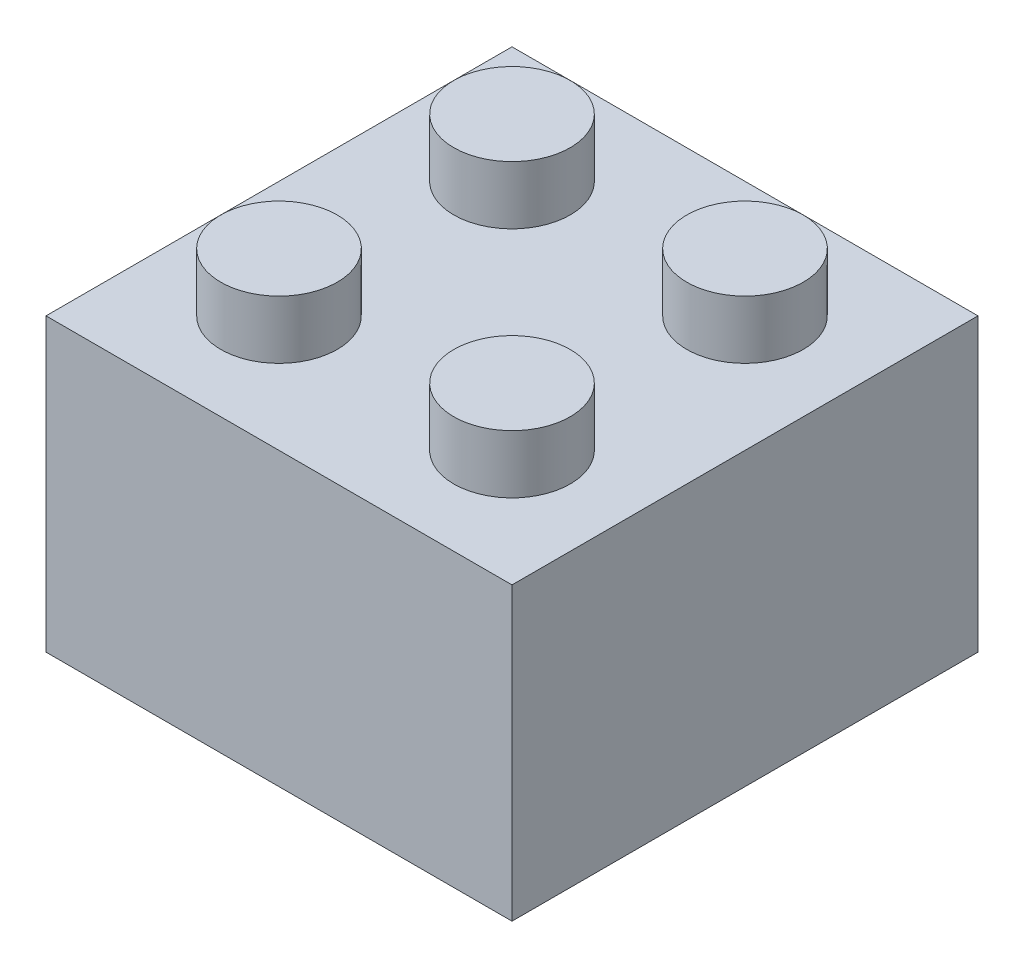
ISO-10303-21;
HEADER;
FILE_DESCRIPTION(('STEP AP214'),'2;1');
FILE_NAME('part.step','',(''),(''),'','','');
FILE_SCHEMA(('AUTOMOTIVE_DESIGN { 1 0 10303 214 1 1 1 1 }'));
ENDSEC;
DATA;
#1=APPLICATION_CONTEXT('core data for automotive mechanical design processes');
#2=APPLICATION_PROTOCOL_DEFINITION('international standard','automotive_design',2000,#1);
#3=PRODUCT_CONTEXT('',#1,'mechanical');
#4=PRODUCT('Part','Part','',(#3));
#5=PRODUCT_RELATED_PRODUCT_CATEGORY('part','',(#4));
#6=PRODUCT_DEFINITION_FORMATION('','',#4);
#7=PRODUCT_DEFINITION_CONTEXT('part definition',#1,'design');
#8=PRODUCT_DEFINITION('design','',#6,#7);
#9=PRODUCT_DEFINITION_SHAPE('','',#8);
#10=(LENGTH_UNIT() NAMED_UNIT(*) SI_UNIT(.MILLI.,.METRE.));
#11=(NAMED_UNIT(*) PLANE_ANGLE_UNIT() SI_UNIT($,.RADIAN.));
#12=(NAMED_UNIT(*) SI_UNIT($,.STERADIAN.) SOLID_ANGLE_UNIT());
#13=UNCERTAINTY_MEASURE_WITH_UNIT(LENGTH_MEASURE(1.E-05),#10,'distance_accuracy_value','');
#14=(GEOMETRIC_REPRESENTATION_CONTEXT(3) GLOBAL_UNCERTAINTY_ASSIGNED_CONTEXT((#13)) GLOBAL_UNIT_ASSIGNED_CONTEXT((#10,
#11,#12)) REPRESENTATION_CONTEXT('',''));
#15=CARTESIAN_POINT('',(0.,0.,0.));
#16=DIRECTION('',(0.,0.,1.));
#17=DIRECTION('',(1.,0.,0.));
#18=AXIS2_PLACEMENT_3D('',#15,#16,#17);
#19=CARTESIAN_POINT('',(8.,10.,-8.));
#20=DIRECTION('',(-1.,0.,0.));
#21=DIRECTION('',(0.,0.,1.));
#22=AXIS2_PLACEMENT_3D('',#19,#20,#21);
#23=PLANE('',#22);
#24=DIRECTION('',(0.,0.,-1.));
#25=VECTOR('',#24,1.);
#26=CARTESIAN_POINT('',(8.,0.,-8.));
#27=LINE('',#26,#25);
#28=CARTESIAN_POINT('',(8.,0.,8.));
#29=VERTEX_POINT('',#28);
#30=CARTESIAN_POINT('',(8.,0.,-8.));
#31=VERTEX_POINT('',#30);
#32=EDGE_CURVE('E204',#29,#31,#27,.T.);
#33=ORIENTED_EDGE('',*,*,#32,.T.);
#34=DIRECTION('',(0.,-1.,0.));
#35=VECTOR('',#34,1.);
#36=CARTESIAN_POINT('',(8.,10.,-8.));
#37=LINE('',#36,#35);
#38=CARTESIAN_POINT('',(8.,10.,-8.));
#39=VERTEX_POINT('',#38);
#40=EDGE_CURVE('E49',#39,#31,#37,.T.);
#41=ORIENTED_EDGE('',*,*,#40,.F.);
#42=DIRECTION('',(0.,0.,-1.));
#43=VECTOR('',#42,1.);
#44=CARTESIAN_POINT('',(8.,10.,-8.));
#45=LINE('',#44,#43);
#46=CARTESIAN_POINT('',(8.,10.,8.));
#47=VERTEX_POINT('',#46);
#48=EDGE_CURVE('E207',#47,#39,#45,.T.);
#49=ORIENTED_EDGE('',*,*,#48,.F.);
#50=DIRECTION('',(0.,-1.,0.));
#51=VECTOR('',#50,1.);
#52=CARTESIAN_POINT('',(8.,10.,8.));
#53=LINE('',#52,#51);
#54=EDGE_CURVE('E213',#47,#29,#53,.T.);
#55=ORIENTED_EDGE('',*,*,#54,.T.);
#56=EDGE_LOOP('',(#33,#41,#49,#55));
#57=FACE_BOUND('',#56,.T.);
#58=ADVANCED_FACE('F42',(#57),#23,.F.);
#59=CARTESIAN_POINT('',(-8.,10.,-8.));
#60=DIRECTION('',(0.,0.,1.));
#61=DIRECTION('',(1.,0.,0.));
#62=AXIS2_PLACEMENT_3D('',#59,#60,#61);
#63=PLANE('',#62);
#64=DIRECTION('',(-1.,0.,0.));
#65=VECTOR('',#64,1.);
#66=CARTESIAN_POINT('',(-8.,0.,-8.));
#67=LINE('',#66,#65);
#68=CARTESIAN_POINT('',(-8.,0.,-8.));
#69=VERTEX_POINT('',#68);
#70=EDGE_CURVE('E216',#31,#69,#67,.T.);
#71=ORIENTED_EDGE('',*,*,#70,.T.);
#72=DIRECTION('',(0.,-1.,0.));
#73=VECTOR('',#72,1.);
#74=CARTESIAN_POINT('',(-8.,10.,-8.));
#75=LINE('',#74,#73);
#76=CARTESIAN_POINT('',(-8.,10.,-8.));
#77=VERTEX_POINT('',#76);
#78=EDGE_CURVE('E224',#77,#69,#75,.T.);
#79=ORIENTED_EDGE('',*,*,#78,.F.);
#80=DIRECTION('',(-1.,0.,0.));
#81=VECTOR('',#80,1.);
#82=CARTESIAN_POINT('',(-8.,10.,-8.));
#83=LINE('',#82,#81);
#84=EDGE_CURVE('E94',#39,#77,#83,.T.);
#85=ORIENTED_EDGE('',*,*,#84,.F.);
#86=ORIENTED_EDGE('',*,*,#40,.T.);
#87=EDGE_LOOP('',(#71,#79,#85,#86));
#88=FACE_BOUND('',#87,.T.);
#89=ADVANCED_FACE('F227',(#88),#63,.F.);
#90=CARTESIAN_POINT('',(-8.,10.,-8.));
#91=DIRECTION('',(1.,0.,0.));
#92=DIRECTION('',(0.,0.,-1.));
#93=AXIS2_PLACEMENT_3D('',#90,#91,#92);
#94=PLANE('',#93);
#95=DIRECTION('',(0.,0.,1.));
#96=VECTOR('',#95,1.);
#97=CARTESIAN_POINT('',(-8.,0.,-8.));
#98=LINE('',#97,#96);
#99=CARTESIAN_POINT('',(-8.,0.,8.));
#100=VERTEX_POINT('',#99);
#101=EDGE_CURVE('E218',#69,#100,#98,.T.);
#102=ORIENTED_EDGE('',*,*,#101,.T.);
#103=DIRECTION('',(0.,-1.,0.));
#104=VECTOR('',#103,1.);
#105=CARTESIAN_POINT('',(-8.,10.,8.));
#106=LINE('',#105,#104);
#107=CARTESIAN_POINT('',(-8.,10.,8.));
#108=VERTEX_POINT('',#107);
#109=EDGE_CURVE('E222',#108,#100,#106,.T.);
#110=ORIENTED_EDGE('',*,*,#109,.F.);
#111=DIRECTION('',(0.,0.,1.));
#112=VECTOR('',#111,1.);
#113=CARTESIAN_POINT('',(-8.,10.,-8.));
#114=LINE('',#113,#112);
#115=EDGE_CURVE('E210',#77,#108,#114,.T.);
#116=ORIENTED_EDGE('',*,*,#115,.F.);
#117=ORIENTED_EDGE('',*,*,#78,.T.);
#118=EDGE_LOOP('',(#102,#110,#116,#117));
#119=FACE_BOUND('',#118,.T.);
#120=ADVANCED_FACE('F236',(#119),#94,.F.);
#121=CARTESIAN_POINT('',(-8.,10.,8.));
#122=DIRECTION('',(0.,0.,-1.));
#123=DIRECTION('',(-1.,0.,0.));
#124=AXIS2_PLACEMENT_3D('',#121,#122,#123);
#125=PLANE('',#124);
#126=DIRECTION('',(1.,0.,0.));
#127=VECTOR('',#126,1.);
#128=CARTESIAN_POINT('',(-8.,0.,8.));
#129=LINE('',#128,#127);
#130=EDGE_CURVE('E86',#100,#29,#129,.T.);
#131=ORIENTED_EDGE('',*,*,#130,.T.);
#132=ORIENTED_EDGE('',*,*,#54,.F.);
#133=DIRECTION('',(1.,0.,0.));
#134=VECTOR('',#133,1.);
#135=CARTESIAN_POINT('',(-8.,10.,8.));
#136=LINE('',#135,#134);
#137=EDGE_CURVE('E65',#108,#47,#136,.T.);
#138=ORIENTED_EDGE('',*,*,#137,.F.);
#139=ORIENTED_EDGE('',*,*,#109,.T.);
#140=EDGE_LOOP('',(#131,#132,#138,#139));
#141=FACE_BOUND('',#140,.T.);
#142=ADVANCED_FACE('F238',(#141),#125,.F.);
#143=CARTESIAN_POINT('',(0.,10.,0.));
#144=DIRECTION('',(0.,1.,0.));
#145=DIRECTION('',(0.,0.,1.));
#146=AXIS2_PLACEMENT_3D('',#143,#144,#145);
#147=PLANE('',#146);
#148=CARTESIAN_POINT('',(-4.,10.,4.));
#149=DIRECTION('',(0.,1.,0.));
#150=DIRECTION('',(0.,0.,-1.));
#151=AXIS2_PLACEMENT_3D('',#148,#149,#150);
#152=CIRCLE('',#151,2.);
#153=CARTESIAN_POINT('',(-4.,10.,2.));
#154=VERTEX_POINT('',#153);
#155=EDGE_CURVE('E143',#154,#154,#152,.T.);
#156=ORIENTED_EDGE('',*,*,#155,.F.);
#157=EDGE_LOOP('',(#156));
#158=FACE_BOUND('',#157,.T.);
#159=CARTESIAN_POINT('',(4.,10.,4.));
#160=DIRECTION('',(0.,1.,0.));
#161=DIRECTION('',(0.,0.,1.));
#162=AXIS2_PLACEMENT_3D('',#159,#160,#161);
#163=CIRCLE('',#162,2.);
#164=CARTESIAN_POINT('',(4.,10.,6.));
#165=VERTEX_POINT('',#164);
#166=EDGE_CURVE('E189',#165,#165,#163,.T.);
#167=ORIENTED_EDGE('',*,*,#166,.F.);
#168=EDGE_LOOP('',(#167));
#169=FACE_BOUND('',#168,.T.);
#170=CARTESIAN_POINT('',(4.,10.,-4.));
#171=DIRECTION('',(0.,1.,0.));
#172=DIRECTION('',(0.,0.,-1.));
#173=AXIS2_PLACEMENT_3D('',#170,#171,#172);
#174=CIRCLE('',#173,2.);
#175=CARTESIAN_POINT('',(4.,10.,-6.));
#176=VERTEX_POINT('',#175);
#177=EDGE_CURVE('E195',#176,#176,#174,.T.);
#178=ORIENTED_EDGE('',*,*,#177,.F.);
#179=EDGE_LOOP('',(#178));
#180=FACE_BOUND('',#179,.T.);
#181=CARTESIAN_POINT('',(-4.,10.,-4.));
#182=DIRECTION('',(0.,1.,0.));
#183=DIRECTION('',(0.,0.,1.));
#184=AXIS2_PLACEMENT_3D('',#181,#182,#183);
#185=CIRCLE('',#184,2.);
#186=CARTESIAN_POINT('',(-4.,10.,-2.));
#187=VERTEX_POINT('',#186);
#188=EDGE_CURVE('E198',#187,#187,#185,.T.);
#189=ORIENTED_EDGE('',*,*,#188,.F.);
#190=EDGE_LOOP('',(#189));
#191=FACE_BOUND('',#190,.T.);
#192=ORIENTED_EDGE('',*,*,#48,.T.);
#193=ORIENTED_EDGE('',*,*,#84,.T.);
#194=ORIENTED_EDGE('',*,*,#115,.T.);
#195=ORIENTED_EDGE('',*,*,#137,.T.);
#196=EDGE_LOOP('',(#192,#193,#194,#195));
#197=FACE_BOUND('',#196,.T.);
#198=ADVANCED_FACE('F239',(#158,#169,#180,#191,#197),#147,.T.);
#199=CARTESIAN_POINT('',(0.,0.,0.));
#200=DIRECTION('',(0.,1.,0.));
#201=DIRECTION('',(0.,0.,1.));
#202=AXIS2_PLACEMENT_3D('',#199,#200,#201);
#203=PLANE('',#202);
#204=DIRECTION('',(1.,0.,0.));
#205=VECTOR('',#204,1.);
#206=CARTESIAN_POINT('',(-8.,0.,7.));
#207=LINE('',#206,#205);
#208=CARTESIAN_POINT('',(-7.,0.,7.));
#209=VERTEX_POINT('',#208);
#210=CARTESIAN_POINT('',(7.,0.,7.));
#211=VERTEX_POINT('',#210);
#212=EDGE_CURVE('E134',#209,#211,#207,.T.);
#213=ORIENTED_EDGE('',*,*,#212,.T.);
#214=DIRECTION('',(0.,0.,-1.));
#215=VECTOR('',#214,1.);
#216=CARTESIAN_POINT('',(7.,0.,-8.));
#217=LINE('',#216,#215);
#218=CARTESIAN_POINT('',(7.,0.,-7.));
#219=VERTEX_POINT('',#218);
#220=EDGE_CURVE('E174',#211,#219,#217,.T.);
#221=ORIENTED_EDGE('',*,*,#220,.T.);
#222=DIRECTION('',(-1.,0.,0.));
#223=VECTOR('',#222,1.);
#224=CARTESIAN_POINT('',(-8.,0.,-7.));
#225=LINE('',#224,#223);
#226=CARTESIAN_POINT('',(-7.,0.,-7.));
#227=VERTEX_POINT('',#226);
#228=EDGE_CURVE('E138',#219,#227,#225,.T.);
#229=ORIENTED_EDGE('',*,*,#228,.T.);
#230=DIRECTION('',(0.,0.,1.));
#231=VECTOR('',#230,1.);
#232=CARTESIAN_POINT('',(-7.,0.,-8.));
#233=LINE('',#232,#231);
#234=EDGE_CURVE('E56',#227,#209,#233,.T.);
#235=ORIENTED_EDGE('',*,*,#234,.T.);
#236=EDGE_LOOP('',(#213,#221,#229,#235));
#237=FACE_BOUND('',#236,.T.);
#238=ORIENTED_EDGE('',*,*,#32,.F.);
#239=ORIENTED_EDGE('',*,*,#130,.F.);
#240=ORIENTED_EDGE('',*,*,#101,.F.);
#241=ORIENTED_EDGE('',*,*,#70,.F.);
#242=EDGE_LOOP('',(#238,#239,#240,#241));
#243=FACE_BOUND('',#242,.T.);
#244=ADVANCED_FACE('F232',(#237,#243),#203,.F.);
#245=CARTESIAN_POINT('',(-4.,12.,-4.));
#246=DIRECTION('',(0.,-1.,0.));
#247=DIRECTION('',(0.,0.,-1.));
#248=AXIS2_PLACEMENT_3D('',#245,#246,#247);
#249=CYLINDRICAL_SURFACE('',#248,2.);
#250=CARTESIAN_POINT('',(-4.,12.,-4.));
#251=DIRECTION('',(0.,1.,0.));
#252=DIRECTION('',(0.,0.,1.));
#253=AXIS2_PLACEMENT_3D('',#250,#251,#252);
#254=CIRCLE('',#253,2.);
#255=CARTESIAN_POINT('',(-4.,12.,-2.));
#256=VERTEX_POINT('',#255);
#257=EDGE_CURVE('E201',#256,#256,#254,.T.);
#258=ORIENTED_EDGE('',*,*,#257,.F.);
#259=EDGE_LOOP('',(#258));
#260=FACE_BOUND('',#259,.T.);
#261=ORIENTED_EDGE('',*,*,#188,.T.);
#262=EDGE_LOOP('',(#261));
#263=FACE_BOUND('',#262,.T.);
#264=ADVANCED_FACE('F247',(#260,#263),#249,.T.);
#265=CARTESIAN_POINT('',(-4.,12.,-4.));
#266=DIRECTION('',(0.,1.,0.));
#267=DIRECTION('',(0.,0.,1.));
#268=AXIS2_PLACEMENT_3D('',#265,#266,#267);
#269=PLANE('',#268);
#270=ORIENTED_EDGE('',*,*,#257,.T.);
#271=EDGE_LOOP('',(#270));
#272=FACE_BOUND('',#271,.T.);
#273=ADVANCED_FACE('F284',(#272),#269,.T.);
#274=CARTESIAN_POINT('',(4.,12.,-4.));
#275=DIRECTION('',(0.,-1.,0.));
#276=DIRECTION('',(0.,0.,-1.));
#277=AXIS2_PLACEMENT_3D('',#274,#275,#276);
#278=CYLINDRICAL_SURFACE('',#277,2.);
#279=CARTESIAN_POINT('',(4.,12.,-4.));
#280=DIRECTION('',(0.,1.,0.));
#281=DIRECTION('',(0.,0.,-1.));
#282=AXIS2_PLACEMENT_3D('',#279,#280,#281);
#283=CIRCLE('',#282,2.);
#284=CARTESIAN_POINT('',(4.,12.,-6.));
#285=VERTEX_POINT('',#284);
#286=EDGE_CURVE('E192',#285,#285,#283,.T.);
#287=ORIENTED_EDGE('',*,*,#286,.F.);
#288=EDGE_LOOP('',(#287));
#289=FACE_BOUND('',#288,.T.);
#290=ORIENTED_EDGE('',*,*,#177,.T.);
#291=EDGE_LOOP('',(#290));
#292=FACE_BOUND('',#291,.T.);
#293=ADVANCED_FACE('F294',(#289,#292),#278,.T.);
#294=CARTESIAN_POINT('',(4.,12.,-4.));
#295=DIRECTION('',(0.,-1.,0.));
#296=DIRECTION('',(0.,0.,-1.));
#297=AXIS2_PLACEMENT_3D('',#294,#295,#296);
#298=PLANE('',#297);
#299=ORIENTED_EDGE('',*,*,#286,.T.);
#300=EDGE_LOOP('',(#299));
#301=FACE_BOUND('',#300,.T.);
#302=ADVANCED_FACE('F305',(#301),#298,.F.);
#303=CARTESIAN_POINT('',(4.,12.,4.));
#304=DIRECTION('',(0.,-1.,0.));
#305=DIRECTION('',(0.,0.,-1.));
#306=AXIS2_PLACEMENT_3D('',#303,#304,#305);
#307=CYLINDRICAL_SURFACE('',#306,2.);
#308=CARTESIAN_POINT('',(4.,12.,4.));
#309=DIRECTION('',(0.,1.,0.));
#310=DIRECTION('',(0.,0.,1.));
#311=AXIS2_PLACEMENT_3D('',#308,#309,#310);
#312=CIRCLE('',#311,2.);
#313=CARTESIAN_POINT('',(4.,12.,6.));
#314=VERTEX_POINT('',#313);
#315=EDGE_CURVE('E187',#314,#314,#312,.T.);
#316=ORIENTED_EDGE('',*,*,#315,.F.);
#317=EDGE_LOOP('',(#316));
#318=FACE_BOUND('',#317,.T.);
#319=ORIENTED_EDGE('',*,*,#166,.T.);
#320=EDGE_LOOP('',(#319));
#321=FACE_BOUND('',#320,.T.);
#322=ADVANCED_FACE('F316',(#318,#321),#307,.T.);
#323=CARTESIAN_POINT('',(4.,12.,4.));
#324=DIRECTION('',(0.,1.,0.));
#325=DIRECTION('',(0.,0.,1.));
#326=AXIS2_PLACEMENT_3D('',#323,#324,#325);
#327=PLANE('',#326);
#328=ORIENTED_EDGE('',*,*,#315,.T.);
#329=EDGE_LOOP('',(#328));
#330=FACE_BOUND('',#329,.T.);
#331=ADVANCED_FACE('F327',(#330),#327,.T.);
#332=CARTESIAN_POINT('',(-4.,12.,4.));
#333=DIRECTION('',(0.,-1.,0.));
#334=DIRECTION('',(0.,0.,-1.));
#335=AXIS2_PLACEMENT_3D('',#332,#333,#334);
#336=CYLINDRICAL_SURFACE('',#335,2.);
#337=CARTESIAN_POINT('',(-4.,12.,4.));
#338=DIRECTION('',(0.,1.,0.));
#339=DIRECTION('',(0.,0.,-1.));
#340=AXIS2_PLACEMENT_3D('',#337,#338,#339);
#341=CIRCLE('',#340,2.);
#342=CARTESIAN_POINT('',(-4.,12.,2.));
#343=VERTEX_POINT('',#342);
#344=EDGE_CURVE('E139',#343,#343,#341,.T.);
#345=ORIENTED_EDGE('',*,*,#344,.F.);
#346=EDGE_LOOP('',(#345));
#347=FACE_BOUND('',#346,.T.);
#348=ORIENTED_EDGE('',*,*,#155,.T.);
#349=EDGE_LOOP('',(#348));
#350=FACE_BOUND('',#349,.T.);
#351=ADVANCED_FACE('F338',(#347,#350),#336,.T.);
#352=CARTESIAN_POINT('',(-4.,12.,4.));
#353=DIRECTION('',(0.,-1.,0.));
#354=DIRECTION('',(0.,0.,-1.));
#355=AXIS2_PLACEMENT_3D('',#352,#353,#354);
#356=PLANE('',#355);
#357=ORIENTED_EDGE('',*,*,#344,.T.);
#358=EDGE_LOOP('',(#357));
#359=FACE_BOUND('',#358,.T.);
#360=ADVANCED_FACE('F349',(#359),#356,.F.);
#361=CARTESIAN_POINT('',(7.,10.,-8.));
#362=DIRECTION('',(-1.,0.,0.));
#363=DIRECTION('',(0.,0.,1.));
#364=AXIS2_PLACEMENT_3D('',#361,#362,#363);
#365=PLANE('',#364);
#366=ORIENTED_EDGE('',*,*,#220,.F.);
#367=DIRECTION('',(0.,-1.,0.));
#368=VECTOR('',#367,1.);
#369=CARTESIAN_POINT('',(7.,10.,7.));
#370=LINE('',#369,#368);
#371=CARTESIAN_POINT('',(7.,9.,7.));
#372=VERTEX_POINT('',#371);
#373=EDGE_CURVE('E133',#372,#211,#370,.T.);
#374=ORIENTED_EDGE('',*,*,#373,.F.);
#375=DIRECTION('',(0.,0.,-1.));
#376=VECTOR('',#375,1.);
#377=CARTESIAN_POINT('',(7.,9.,-8.));
#378=LINE('',#377,#376);
#379=CARTESIAN_POINT('',(7.,9.,-7.));
#380=VERTEX_POINT('',#379);
#381=EDGE_CURVE('E121',#372,#380,#378,.T.);
#382=ORIENTED_EDGE('',*,*,#381,.T.);
#383=DIRECTION('',(0.,-1.,0.));
#384=VECTOR('',#383,1.);
#385=CARTESIAN_POINT('',(7.,10.,-7.));
#386=LINE('',#385,#384);
#387=EDGE_CURVE('E131',#380,#219,#386,.T.);
#388=ORIENTED_EDGE('',*,*,#387,.T.);
#389=EDGE_LOOP('',(#366,#374,#382,#388));
#390=FACE_BOUND('',#389,.T.);
#391=ADVANCED_FACE('F130',(#390),#365,.T.);
#392=CARTESIAN_POINT('',(-8.,10.,-7.));
#393=DIRECTION('',(0.,0.,1.));
#394=DIRECTION('',(1.,0.,0.));
#395=AXIS2_PLACEMENT_3D('',#392,#393,#394);
#396=PLANE('',#395);
#397=ORIENTED_EDGE('',*,*,#228,.F.);
#398=ORIENTED_EDGE('',*,*,#387,.F.);
#399=DIRECTION('',(-1.,0.,0.));
#400=VECTOR('',#399,1.);
#401=CARTESIAN_POINT('',(-8.,9.,-7.));
#402=LINE('',#401,#400);
#403=CARTESIAN_POINT('',(-7.,9.,-7.));
#404=VERTEX_POINT('',#403);
#405=EDGE_CURVE('E117',#380,#404,#402,.T.);
#406=ORIENTED_EDGE('',*,*,#405,.T.);
#407=DIRECTION('',(0.,-1.,0.));
#408=VECTOR('',#407,1.);
#409=CARTESIAN_POINT('',(-7.,10.,-7.));
#410=LINE('',#409,#408);
#411=EDGE_CURVE('E140',#404,#227,#410,.T.);
#412=ORIENTED_EDGE('',*,*,#411,.T.);
#413=EDGE_LOOP('',(#397,#398,#406,#412));
#414=FACE_BOUND('',#413,.T.);
#415=ADVANCED_FACE('F136',(#414),#396,.T.);
#416=CARTESIAN_POINT('',(-7.,10.,-8.));
#417=DIRECTION('',(1.,0.,0.));
#418=DIRECTION('',(0.,0.,-1.));
#419=AXIS2_PLACEMENT_3D('',#416,#417,#418);
#420=PLANE('',#419);
#421=ORIENTED_EDGE('',*,*,#234,.F.);
#422=ORIENTED_EDGE('',*,*,#411,.F.);
#423=DIRECTION('',(0.,0.,1.));
#424=VECTOR('',#423,1.);
#425=CARTESIAN_POINT('',(-7.,9.,-8.));
#426=LINE('',#425,#424);
#427=CARTESIAN_POINT('',(-7.,9.,7.));
#428=VERTEX_POINT('',#427);
#429=EDGE_CURVE('E122',#404,#428,#426,.T.);
#430=ORIENTED_EDGE('',*,*,#429,.T.);
#431=DIRECTION('',(0.,-1.,0.));
#432=VECTOR('',#431,1.);
#433=CARTESIAN_POINT('',(-7.,10.,7.));
#434=LINE('',#433,#432);
#435=EDGE_CURVE('E145',#428,#209,#434,.T.);
#436=ORIENTED_EDGE('',*,*,#435,.T.);
#437=EDGE_LOOP('',(#421,#422,#430,#436));
#438=FACE_BOUND('',#437,.T.);
#439=ADVANCED_FACE('F385',(#438),#420,.T.);
#440=CARTESIAN_POINT('',(-8.,10.,7.));
#441=DIRECTION('',(0.,0.,-1.));
#442=DIRECTION('',(-1.,0.,0.));
#443=AXIS2_PLACEMENT_3D('',#440,#441,#442);
#444=PLANE('',#443);
#445=ORIENTED_EDGE('',*,*,#212,.F.);
#446=ORIENTED_EDGE('',*,*,#435,.F.);
#447=DIRECTION('',(1.,0.,0.));
#448=VECTOR('',#447,1.);
#449=CARTESIAN_POINT('',(-8.,9.,7.));
#450=LINE('',#449,#448);
#451=EDGE_CURVE('E151',#428,#372,#450,.T.);
#452=ORIENTED_EDGE('',*,*,#451,.T.);
#453=ORIENTED_EDGE('',*,*,#373,.T.);
#454=EDGE_LOOP('',(#445,#446,#452,#453));
#455=FACE_BOUND('',#454,.T.);
#456=ADVANCED_FACE('F395',(#455),#444,.T.);
#457=CARTESIAN_POINT('',(0.,9.,0.));
#458=DIRECTION('',(0.,1.,0.));
#459=DIRECTION('',(0.,0.,1.));
#460=AXIS2_PLACEMENT_3D('',#457,#458,#459);
#461=PLANE('',#460);
#462=CARTESIAN_POINT('',(0.,9.,0.));
#463=DIRECTION('',(0.,1.,0.));
#464=DIRECTION('',(0.,0.,1.));
#465=AXIS2_PLACEMENT_3D('',#462,#463,#464);
#466=CIRCLE('',#465,2.7);
#467=CARTESIAN_POINT('',(0.,9.,2.7));
#468=VERTEX_POINT('',#467);
#469=EDGE_CURVE('E11',#468,#468,#466,.F.);
#470=ORIENTED_EDGE('',*,*,#469,.F.);
#471=EDGE_LOOP('',(#470));
#472=FACE_BOUND('',#471,.T.);
#473=CARTESIAN_POINT('',(-4.,9.,4.));
#474=DIRECTION('',(0.,1.,0.));
#475=DIRECTION('',(0.,0.,1.));
#476=AXIS2_PLACEMENT_3D('',#473,#474,#475);
#477=CIRCLE('',#476,1.);
#478=CARTESIAN_POINT('',(-4.,9.,5.));
#479=VERTEX_POINT('',#478);
#480=EDGE_CURVE('E156',#479,#479,#477,.T.);
#481=ORIENTED_EDGE('',*,*,#480,.T.);
#482=EDGE_LOOP('',(#481));
#483=FACE_BOUND('',#482,.T.);
#484=CARTESIAN_POINT('',(4.,9.,4.));
#485=DIRECTION('',(0.,1.,0.));
#486=DIRECTION('',(0.,0.,1.));
#487=AXIS2_PLACEMENT_3D('',#484,#485,#486);
#488=CIRCLE('',#487,1.);
#489=CARTESIAN_POINT('',(4.,9.,5.));
#490=VERTEX_POINT('',#489);
#491=EDGE_CURVE('E161',#490,#490,#488,.T.);
#492=ORIENTED_EDGE('',*,*,#491,.T.);
#493=EDGE_LOOP('',(#492));
#494=FACE_BOUND('',#493,.T.);
#495=CARTESIAN_POINT('',(4.,9.,-4.));
#496=DIRECTION('',(0.,1.,0.));
#497=DIRECTION('',(0.,0.,1.));
#498=AXIS2_PLACEMENT_3D('',#495,#496,#497);
#499=CIRCLE('',#498,1.);
#500=CARTESIAN_POINT('',(4.,9.,-3.));
#501=VERTEX_POINT('',#500);
#502=EDGE_CURVE('E165',#501,#501,#499,.T.);
#503=ORIENTED_EDGE('',*,*,#502,.T.);
#504=EDGE_LOOP('',(#503));
#505=FACE_BOUND('',#504,.T.);
#506=CARTESIAN_POINT('',(-4.,9.,-4.));
#507=DIRECTION('',(0.,1.,0.));
#508=DIRECTION('',(0.,0.,1.));
#509=AXIS2_PLACEMENT_3D('',#506,#507,#508);
#510=CIRCLE('',#509,1.);
#511=CARTESIAN_POINT('',(-4.,9.,-3.));
#512=VERTEX_POINT('',#511);
#513=EDGE_CURVE('E168',#512,#512,#510,.T.);
#514=ORIENTED_EDGE('',*,*,#513,.T.);
#515=EDGE_LOOP('',(#514));
#516=FACE_BOUND('',#515,.T.);
#517=ORIENTED_EDGE('',*,*,#381,.F.);
#518=ORIENTED_EDGE('',*,*,#451,.F.);
#519=ORIENTED_EDGE('',*,*,#429,.F.);
#520=ORIENTED_EDGE('',*,*,#405,.F.);
#521=EDGE_LOOP('',(#517,#518,#519,#520));
#522=FACE_BOUND('',#521,.T.);
#523=ADVANCED_FACE('F119',(#472,#483,#494,#505,#516,#522),#461,.F.);
#524=CARTESIAN_POINT('',(-4.,12.,-4.));
#525=DIRECTION('',(0.,-1.,0.));
#526=DIRECTION('',(0.,0.,-1.));
#527=AXIS2_PLACEMENT_3D('',#524,#525,#526);
#528=CYLINDRICAL_SURFACE('',#527,1.);
#529=CARTESIAN_POINT('',(-4.,11.,-4.));
#530=DIRECTION('',(0.,1.,0.));
#531=DIRECTION('',(0.,0.,1.));
#532=AXIS2_PLACEMENT_3D('',#529,#530,#531);
#533=CIRCLE('',#532,1.);
#534=CARTESIAN_POINT('',(-4.,11.,-3.));
#535=VERTEX_POINT('',#534);
#536=EDGE_CURVE('E171',#535,#535,#533,.T.);
#537=ORIENTED_EDGE('',*,*,#536,.T.);
#538=EDGE_LOOP('',(#537));
#539=FACE_BOUND('',#538,.T.);
#540=ORIENTED_EDGE('',*,*,#513,.F.);
#541=EDGE_LOOP('',(#540));
#542=FACE_BOUND('',#541,.T.);
#543=ADVANCED_FACE('F413',(#539,#542),#528,.F.);
#544=CARTESIAN_POINT('',(-4.,11.,-4.));
#545=DIRECTION('',(0.,1.,0.));
#546=DIRECTION('',(0.,0.,1.));
#547=AXIS2_PLACEMENT_3D('',#544,#545,#546);
#548=PLANE('',#547);
#549=ORIENTED_EDGE('',*,*,#536,.F.);
#550=EDGE_LOOP('',(#549));
#551=FACE_BOUND('',#550,.T.);
#552=ADVANCED_FACE('F418',(#551),#548,.F.);
#553=CARTESIAN_POINT('',(4.,12.,-4.));
#554=DIRECTION('',(0.,-1.,0.));
#555=DIRECTION('',(0.,0.,-1.));
#556=AXIS2_PLACEMENT_3D('',#553,#554,#555);
#557=CYLINDRICAL_SURFACE('',#556,1.);
#558=CARTESIAN_POINT('',(4.,11.,-4.));
#559=DIRECTION('',(0.,-1.,0.));
#560=DIRECTION('',(0.,0.,-1.));
#561=AXIS2_PLACEMENT_3D('',#558,#559,#560);
#562=CIRCLE('',#561,1.);
#563=CARTESIAN_POINT('',(4.,11.,-5.));
#564=VERTEX_POINT('',#563);
#565=EDGE_CURVE('E164',#564,#564,#562,.F.);
#566=ORIENTED_EDGE('',*,*,#565,.T.);
#567=EDGE_LOOP('',(#566));
#568=FACE_BOUND('',#567,.T.);
#569=ORIENTED_EDGE('',*,*,#502,.F.);
#570=EDGE_LOOP('',(#569));
#571=FACE_BOUND('',#570,.T.);
#572=ADVANCED_FACE('F429',(#568,#571),#557,.F.);
#573=CARTESIAN_POINT('',(4.,11.,-4.));
#574=DIRECTION('',(0.,-1.,0.));
#575=DIRECTION('',(0.,0.,-1.));
#576=AXIS2_PLACEMENT_3D('',#573,#574,#575);
#577=PLANE('',#576);
#578=ORIENTED_EDGE('',*,*,#565,.F.);
#579=EDGE_LOOP('',(#578));
#580=FACE_BOUND('',#579,.T.);
#581=ADVANCED_FACE('F440',(#580),#577,.T.);
#582=CARTESIAN_POINT('',(4.,12.,4.));
#583=DIRECTION('',(0.,-1.,0.));
#584=DIRECTION('',(0.,0.,-1.));
#585=AXIS2_PLACEMENT_3D('',#582,#583,#584);
#586=CYLINDRICAL_SURFACE('',#585,1.);
#587=CARTESIAN_POINT('',(4.,11.,4.));
#588=DIRECTION('',(0.,1.,0.));
#589=DIRECTION('',(0.,0.,1.));
#590=AXIS2_PLACEMENT_3D('',#587,#588,#589);
#591=CIRCLE('',#590,1.);
#592=CARTESIAN_POINT('',(4.,11.,5.));
#593=VERTEX_POINT('',#592);
#594=EDGE_CURVE('E159',#593,#593,#591,.T.);
#595=ORIENTED_EDGE('',*,*,#594,.T.);
#596=EDGE_LOOP('',(#595));
#597=FACE_BOUND('',#596,.T.);
#598=ORIENTED_EDGE('',*,*,#491,.F.);
#599=EDGE_LOOP('',(#598));
#600=FACE_BOUND('',#599,.T.);
#601=ADVANCED_FACE('F451',(#597,#600),#586,.F.);
#602=CARTESIAN_POINT('',(4.,11.,4.));
#603=DIRECTION('',(0.,1.,0.));
#604=DIRECTION('',(0.,0.,1.));
#605=AXIS2_PLACEMENT_3D('',#602,#603,#604);
#606=PLANE('',#605);
#607=ORIENTED_EDGE('',*,*,#594,.F.);
#608=EDGE_LOOP('',(#607));
#609=FACE_BOUND('',#608,.T.);
#610=ADVANCED_FACE('F462',(#609),#606,.F.);
#611=CARTESIAN_POINT('',(-4.,12.,4.));
#612=DIRECTION('',(0.,-1.,0.));
#613=DIRECTION('',(0.,0.,-1.));
#614=AXIS2_PLACEMENT_3D('',#611,#612,#613);
#615=CYLINDRICAL_SURFACE('',#614,1.);
#616=CARTESIAN_POINT('',(-4.,11.,4.));
#617=DIRECTION('',(0.,-1.,0.));
#618=DIRECTION('',(0.,0.,-1.));
#619=AXIS2_PLACEMENT_3D('',#616,#617,#618);
#620=CIRCLE('',#619,1.);
#621=CARTESIAN_POINT('',(-4.,11.,3.));
#622=VERTEX_POINT('',#621);
#623=EDGE_CURVE('E160',#622,#622,#620,.F.);
#624=ORIENTED_EDGE('',*,*,#623,.T.);
#625=EDGE_LOOP('',(#624));
#626=FACE_BOUND('',#625,.T.);
#627=ORIENTED_EDGE('',*,*,#480,.F.);
#628=EDGE_LOOP('',(#627));
#629=FACE_BOUND('',#628,.T.);
#630=ADVANCED_FACE('F473',(#626,#629),#615,.F.);
#631=CARTESIAN_POINT('',(-4.,11.,4.));
#632=DIRECTION('',(0.,-1.,0.));
#633=DIRECTION('',(0.,0.,-1.));
#634=AXIS2_PLACEMENT_3D('',#631,#632,#633);
#635=PLANE('',#634);
#636=ORIENTED_EDGE('',*,*,#623,.F.);
#637=EDGE_LOOP('',(#636));
#638=FACE_BOUND('',#637,.T.);
#639=ADVANCED_FACE('F484',(#638),#635,.T.);
#640=CARTESIAN_POINT('',(0.,0.,0.));
#641=DIRECTION('',(0.,-1.,0.));
#642=DIRECTION('',(0.,0.,-1.));
#643=AXIS2_PLACEMENT_3D('',#640,#641,#642);
#644=PLANE('',#643);
#645=CARTESIAN_POINT('',(0.,0.,0.));
#646=DIRECTION('',(0.,-1.,0.));
#647=DIRECTION('',(0.,0.,-1.));
#648=AXIS2_PLACEMENT_3D('',#645,#646,#647);
#649=CIRCLE('',#648,2.7);
#650=CARTESIAN_POINT('',(0.,0.,-2.7));
#651=VERTEX_POINT('',#650);
#652=EDGE_CURVE('E148',#651,#651,#649,.T.);
#653=ORIENTED_EDGE('',*,*,#652,.T.);
#654=EDGE_LOOP('',(#653));
#655=FACE_BOUND('',#654,.T.);
#656=CARTESIAN_POINT('',(0.,0.,0.));
#657=DIRECTION('',(0.,-1.,0.));
#658=DIRECTION('',(0.,0.,-1.));
#659=AXIS2_PLACEMENT_3D('',#656,#657,#658);
#660=CIRCLE('',#659,1.7);
#661=CARTESIAN_POINT('',(0.,0.,-1.7));
#662=VERTEX_POINT('',#661);
#663=EDGE_CURVE('E599',#662,#662,#660,.T.);
#664=ORIENTED_EDGE('',*,*,#663,.F.);
#665=EDGE_LOOP('',(#664));
#666=FACE_BOUND('',#665,.T.);
#667=ADVANCED_FACE('F495',(#655,#666),#644,.T.);
#668=CARTESIAN_POINT('',(0.,0.,0.));
#669=DIRECTION('',(0.,1.,0.));
#670=DIRECTION('',(0.,0.,1.));
#671=AXIS2_PLACEMENT_3D('',#668,#669,#670);
#672=CYLINDRICAL_SURFACE('',#671,2.7);
#673=ORIENTED_EDGE('',*,*,#652,.F.);
#674=EDGE_LOOP('',(#673));
#675=FACE_BOUND('',#674,.T.);
#676=ORIENTED_EDGE('',*,*,#469,.T.);
#677=EDGE_LOOP('',(#676));
#678=FACE_BOUND('',#677,.T.);
#679=ADVANCED_FACE('F516',(#675,#678),#672,.T.);
#680=CARTESIAN_POINT('',(0.,0.,0.));
#681=DIRECTION('',(0.,1.,0.));
#682=DIRECTION('',(0.,0.,1.));
#683=AXIS2_PLACEMENT_3D('',#680,#681,#682);
#684=CYLINDRICAL_SURFACE('',#683,1.7);
#685=ORIENTED_EDGE('',*,*,#663,.T.);
#686=EDGE_LOOP('',(#685));
#687=FACE_BOUND('',#686,.T.);
#688=CARTESIAN_POINT('',(0.,9.,0.));
#689=DIRECTION('',(0.,-1.,0.));
#690=DIRECTION('',(0.,0.,-1.));
#691=AXIS2_PLACEMENT_3D('',#688,#689,#690);
#692=CIRCLE('',#691,1.7);
#693=CARTESIAN_POINT('',(0.,9.,-1.7));
#694=VERTEX_POINT('',#693);
#695=EDGE_CURVE('E597',#694,#694,#692,.T.);
#696=ORIENTED_EDGE('',*,*,#695,.F.);
#697=EDGE_LOOP('',(#696));
#698=FACE_BOUND('',#697,.T.);
#699=ADVANCED_FACE('F527',(#687,#698),#684,.F.);
#700=ORIENTED_EDGE('',*,*,#695,.T.);
#701=EDGE_LOOP('',(#700));
#702=FACE_BOUND('',#701,.T.);
#703=ADVANCED_FACE('F508',(#702),#461,.F.);
#704=CLOSED_SHELL('',(#58,#89,#120,#142,#198,#244,#264,#273,#293,#302,#322,#331,#351,#360,#391,
#415,#439,#456,#523,#543,#552,#572,#581,#601,#610,#630,#639,#667,#679,#699,#703));
#705=MANIFOLD_SOLID_BREP('B2',#704);
#706=ADVANCED_BREP_SHAPE_REPRESENTATION('',(#18,#705),#14);
#707=SHAPE_DEFINITION_REPRESENTATION(#9,#706);
ENDSEC;
END-ISO-10303-21;
